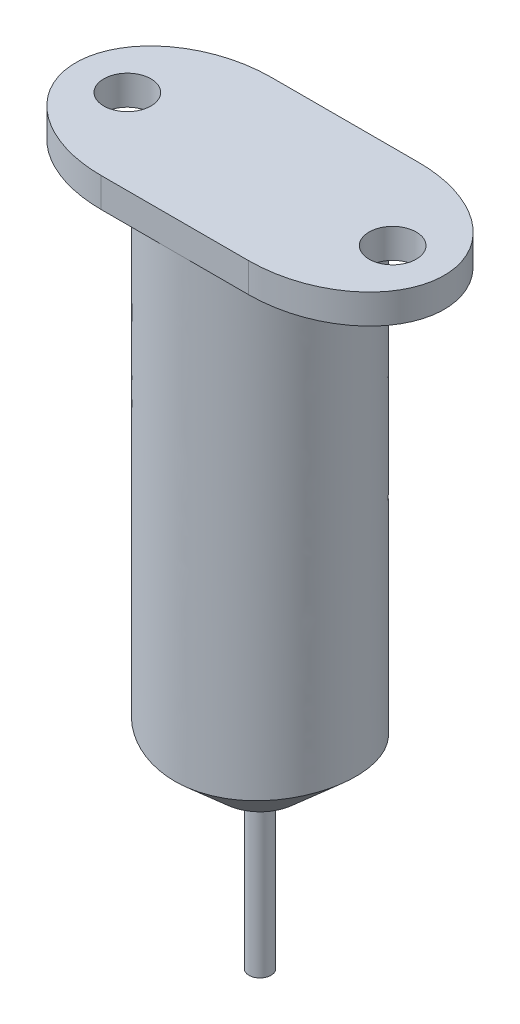
ISO-10303-21;
HEADER;
FILE_DESCRIPTION(('STEP AP214'),'2;1');
FILE_NAME('part.step','',(''),(''),'','','');
FILE_SCHEMA(('AUTOMOTIVE_DESIGN { 1 0 10303 214 1 1 1 1 }'));
ENDSEC;
DATA;
#1=APPLICATION_CONTEXT('core data for automotive mechanical design processes');
#2=APPLICATION_PROTOCOL_DEFINITION('international standard','automotive_design',2000,#1);
#3=PRODUCT_CONTEXT('',#1,'mechanical');
#4=PRODUCT('Part','Part','',(#3));
#5=PRODUCT_RELATED_PRODUCT_CATEGORY('part','',(#4));
#6=PRODUCT_DEFINITION_FORMATION('','',#4);
#7=PRODUCT_DEFINITION_CONTEXT('part definition',#1,'design');
#8=PRODUCT_DEFINITION('design','',#6,#7);
#9=PRODUCT_DEFINITION_SHAPE('','',#8);
#10=(LENGTH_UNIT() NAMED_UNIT(*) SI_UNIT(.MILLI.,.METRE.));
#11=(NAMED_UNIT(*) PLANE_ANGLE_UNIT() SI_UNIT($,.RADIAN.));
#12=(NAMED_UNIT(*) SI_UNIT($,.STERADIAN.) SOLID_ANGLE_UNIT());
#13=UNCERTAINTY_MEASURE_WITH_UNIT(LENGTH_MEASURE(1.E-05),#10,'distance_accuracy_value','');
#14=(GEOMETRIC_REPRESENTATION_CONTEXT(3) GLOBAL_UNCERTAINTY_ASSIGNED_CONTEXT((#13)) GLOBAL_UNIT_ASSIGNED_CONTEXT((#10,
#11,#12)) REPRESENTATION_CONTEXT('',''));
#15=CARTESIAN_POINT('',(0.,0.,0.));
#16=DIRECTION('',(0.,0.,1.));
#17=DIRECTION('',(1.,0.,0.));
#18=AXIS2_PLACEMENT_3D('',#15,#16,#17);
#19=CARTESIAN_POINT('',(0.,45.,0.));
#20=DIRECTION('',(0.,1.,0.));
#21=DIRECTION('',(-0.999622892301415,0.,0.0274603930589759));
#22=AXIS2_PLACEMENT_3D('',#19,#20,#21);
#23=ELLIPSE('',#22,6.50245212475592,5.77217673228334);
#24=DIRECTION('',(0.,-1.,0.));
#25=VECTOR('',#24,1.);
#26=SURFACE_OF_LINEAR_EXTRUSION('',#23,#25);
#27=CARTESIAN_POINT('',(-6.5,14.5577352220053,0.178559891192971));
#28=CARTESIAN_POINT('',(-6.49564268552522,14.5577346311499,0.337107868766625));
#29=CARTESIAN_POINT('',(-6.48391484161751,14.5563432852523,0.495486520774825));
#30=CARTESIAN_POINT('',(-6.44585067105374,14.5508181605295,0.810521077001312));
#31=CARTESIAN_POINT('',(-6.41950418876631,14.5466824748079,0.967175706290462));
#32=CARTESIAN_POINT('',(-6.35254803655993,14.5357928572982,1.27740070330976));
#33=CARTESIAN_POINT('',(-6.31193061655698,14.5290375026456,1.43096934713757));
#34=CARTESIAN_POINT('',(-6.21702032233599,14.5131178025009,1.7335920719539));
#35=CARTESIAN_POINT('',(-6.16273495384329,14.5039547790551,1.88264858060881));
#36=CARTESIAN_POINT('',(-6.04761214513408,14.4845688628163,2.15975643810702));
#37=CARTESIAN_POINT('',(-5.98807182013317,14.4745600492518,2.28836382999139));
#38=CARTESIAN_POINT('',(-5.85926974223257,14.4530691951381,2.54032763955964));
#39=CARTESIAN_POINT('',(-5.79001548737615,14.4415882914555,2.66368801252322));
#40=CARTESIAN_POINT('',(-5.56698287588831,14.4050399502104,3.02766375755327));
#41=CARTESIAN_POINT('',(-5.39902848239854,14.3780566271258,3.2595672572421));
#42=CARTESIAN_POINT('',(-5.03109449917353,14.321274529012,3.69619107506801));
#43=CARTESIAN_POINT('',(-4.83108198849339,14.2914728728342,3.90088304967686));
#44=CARTESIAN_POINT('',(-4.4971565744832,14.2444364639475,4.19807076416744));
#45=CARTESIAN_POINT('',(-4.37212909607511,14.2273485171007,4.30076608630012));
#46=CARTESIAN_POINT('',(-4.11465495560948,14.193450018976,4.49616314044058));
#47=CARTESIAN_POINT('',(-3.98221660041981,14.1766391834114,4.58887573413183));
#48=CARTESIAN_POINT('',(-3.71075469749367,14.143678460735,4.76414237491037));
#49=CARTESIAN_POINT('',(-3.57173268174104,14.1275284214739,4.84669876936278));
#50=CARTESIAN_POINT('',(-3.28785252104862,14.0962450758381,5.00154870798258));
#51=CARTESIAN_POINT('',(-3.1429893785676,14.0811126709777,5.07383321384837));
#52=CARTESIAN_POINT('',(-2.69832124206559,14.0375260214663,5.27617462040616));
#53=CARTESIAN_POINT('',(-2.39083425502038,14.0111826815866,5.3901824045187));
#54=CARTESIAN_POINT('',(-1.76246703827514,13.9665948213839,5.57456593397849));
#55=CARTESIAN_POINT('',(-1.44158284451837,13.9483527169569,5.64492866626996));
#56=CARTESIAN_POINT('',(-0.926592013556915,13.9271406191975,5.7217012749021));
#57=CARTESIAN_POINT('',(-0.734648216525613,13.9209751367441,5.74251288506397));
#58=CARTESIAN_POINT('',(-0.349746209101995,13.9122148249361,5.76886258296317));
#59=CARTESIAN_POINT('',(-0.156788849734979,13.9096173697072,5.7744119059325));
#60=CARTESIAN_POINT('',(0.229018585657553,13.9080748891347,5.77026593366935));
#61=CARTESIAN_POINT('',(0.421868621433498,13.9091308014531,5.76056672514465));
#62=CARTESIAN_POINT('',(0.806181143338068,13.9148610139326,5.72596386694229));
#63=CARTESIAN_POINT('',(0.997643366719899,13.9195359820949,5.7010574105078));
#64=CARTESIAN_POINT('',(1.37784315985664,13.9323540511507,5.63612345534608));
#65=CARTESIAN_POINT('',(1.56658127288944,13.9404964503596,5.59609901614548));
#66=CARTESIAN_POINT('',(1.9401005790579,13.9599788480211,5.50106433100182));
#67=CARTESIAN_POINT('',(2.12488036524323,13.9713199637836,5.44604884892417));
#68=CARTESIAN_POINT('',(2.66733759171398,14.0093441397741,5.26009067999469));
#69=CARTESIAN_POINT('',(3.01758598784452,14.0401918563695,5.10747635442086));
#70=CARTESIAN_POINT('',(3.67386815812256,14.1078847573579,4.75303515752966));
#71=CARTESIAN_POINT('',(3.98109970367889,14.1444460452239,4.55338206232378));
#72=CARTESIAN_POINT('',(4.40521396374506,14.2001177941979,4.22317994926528));
#73=CARTESIAN_POINT('',(4.53721774838329,14.2182919459324,4.11152015468757));
#74=CARTESIAN_POINT('',(4.79144206571678,14.2546949735827,3.87761866935245));
#75=CARTESIAN_POINT('',(4.9136671664535,14.2729238197702,3.75538197572593));
#76=CARTESIAN_POINT('',(5.14026264580795,14.307860532072,3.50839751010545));
#77=CARTESIAN_POINT('',(5.24526231226793,14.3245944319765,3.38423004572123));
#78=CARTESIAN_POINT('',(5.44460225584404,14.3572301971997,3.12755957118415));
#79=CARTESIAN_POINT('',(5.53894628624014,14.3731323544203,2.9950595218156));
#80=CARTESIAN_POINT('',(5.7108721950928,14.4027971619994,2.73030503068256));
#81=CARTESIAN_POINT('',(5.78910975410502,14.4166304516897,2.59848428904223));
#82=CARTESIAN_POINT('',(5.9345633373357,14.4428613850471,2.32855894880352));
#83=CARTESIAN_POINT('',(6.00176739228571,14.4552574653875,2.19044773093002));
#84=CARTESIAN_POINT('',(6.12217715767357,14.4778808255744,1.9137426857152));
#85=CARTESIAN_POINT('',(6.17578475280842,14.4881680246356,1.77532875513494));
#86=CARTESIAN_POINT('',(6.27131473510146,14.5068365832698,1.4943288198223));
#87=CARTESIAN_POINT('',(6.31323243723898,14.5152171784757,1.35174116758916));
#88=CARTESIAN_POINT('',(6.38480918419144,14.5298459581054,1.06349315401138));
#89=CARTESIAN_POINT('',(6.41447504101699,14.5360953271504,0.91783454759457));
#90=CARTESIAN_POINT('',(6.46117319961344,14.5462993062099,0.624491324549964));
#91=CARTESIAN_POINT('',(6.47821147182875,14.5502550005032,0.476807699055086));
#92=CARTESIAN_POINT('',(6.49911522598288,14.5556868113793,0.184889416268921));
#93=CARTESIAN_POINT('',(6.50335783599687,14.5572332529635,0.0406830009112493));
#94=CARTESIAN_POINT('',(6.49966748432606,14.5580295195383,-0.247541482962426));
#95=CARTESIAN_POINT('',(6.49173795781739,14.5572799924294,-0.391559593141967));
#96=CARTESIAN_POINT('',(6.4639127240533,14.5535218145439,-0.677117153590232));
#97=CARTESIAN_POINT('',(6.44412338187759,14.5505331863075,-0.818667261028505));
#98=CARTESIAN_POINT('',(6.39288146458693,14.5423942165786,-1.09962666443907));
#99=CARTESIAN_POINT('',(6.36142471211212,14.5372431007491,-1.239035175001));
#100=CARTESIAN_POINT('',(6.2871483476748,14.5248977403395,-1.51491730936029));
#101=CARTESIAN_POINT('',(6.2443118663192,14.5177004613915,-1.65138624812768));
#102=CARTESIAN_POINT('',(6.14774993845342,14.5014378477465,-1.920350820825));
#103=CARTESIAN_POINT('',(6.09402049739178,14.4923718277441,-2.05284497664387));
#104=CARTESIAN_POINT('',(5.97557557007335,14.4724750591529,-2.3144998238384));
#105=CARTESIAN_POINT('',(5.91074278911893,14.4616255246802,-2.4436059204042));
#106=CARTESIAN_POINT('',(5.7711394163585,14.4384835333932,-2.69625459113307));
#107=CARTESIAN_POINT('',(5.69636467414781,14.426190474212,-2.81979481275148));
#108=CARTESIAN_POINT('',(5.53770386302273,14.4004593764562,-3.06047936360713));
#109=CARTESIAN_POINT('',(5.45383150593176,14.3870230673873,-3.17763292903817));
#110=CARTESIAN_POINT('',(5.27758570064416,14.3592774389311,-3.40525492522882));
#111=CARTESIAN_POINT('',(5.18521141861595,14.3449680339607,-3.51572269851029));
#112=CARTESIAN_POINT('',(4.98521309619861,14.3146418552406,-3.73784038876375));
#113=CARTESIAN_POINT('',(4.87696213240554,14.2985786469657,-3.84892028095591));
#114=CARTESIAN_POINT('',(4.65232870870168,14.2661598078381,-4.06240287879668));
#115=CARTESIAN_POINT('',(4.53594694485021,14.2498042021059,-4.16480632555935));
#116=CARTESIAN_POINT('',(4.17349148606768,14.2005281237089,-4.46044536091017));
#117=CARTESIAN_POINT('',(3.91603877225633,14.1677002755783,-4.63998307242447));
#118=CARTESIAN_POINT('',(3.37777964010551,14.105209952202,-4.96064404044764));
#119=CARTESIAN_POINT('',(3.09695628853842,14.0755498082799,-5.10173912132738));
#120=CARTESIAN_POINT('',(2.64000825862981,14.0332146580667,-5.29332184901522));
#121=CARTESIAN_POINT('',(2.46944814883127,14.018637990024,-5.35697528159644));
#122=CARTESIAN_POINT('',(2.12384547072552,13.9918241456876,-5.47080773388818));
#123=CARTESIAN_POINT('',(1.94880685498851,13.9795849820222,-5.52099821476738));
#124=CARTESIAN_POINT('',(1.59522496258492,13.957786571979,-5.60786350274171));
#125=CARTESIAN_POINT('',(1.41668111607285,13.9482277652725,-5.64453609274491));
#126=CARTESIAN_POINT('',(1.05716336486212,13.9320662760946,-5.70429657837773));
#127=CARTESIAN_POINT('',(0.876188955127212,13.9254642180963,-5.72738160460101));
#128=CARTESIAN_POINT('',(0.512992511956759,13.9154132991876,-5.75991223676583));
#129=CARTESIAN_POINT('',(0.330770902169302,13.9119634163655,-5.7693622636488));
#130=CARTESIAN_POINT('',(-0.0339585524191175,13.9083132123711,-5.77463384307531));
#131=CARTESIAN_POINT('',(-0.21646646880919,13.9081139058121,-5.77045114087872));
#132=CARTESIAN_POINT('',(-0.580580039396283,13.9109728741913,-5.74847880093398));
#133=CARTESIAN_POINT('',(-0.762185951999933,13.9140301547848,-5.7306933170365));
#134=CARTESIAN_POINT('',(-1.12353265130875,13.9233128986598,-5.68157233557689));
#135=CARTESIAN_POINT('',(-1.30327284301993,13.9295393427477,-5.65023264365156));
#136=CARTESIAN_POINT('',(-1.65970979862632,13.944977859495,-5.5741030091585));
#137=CARTESIAN_POINT('',(-1.83640725958474,13.9541892384847,-5.52931619174851));
#138=CARTESIAN_POINT('',(-2.18576836565442,13.9753345639922,-5.42639807054195));
#139=CARTESIAN_POINT('',(-2.35843075125858,13.9872693484031,-5.36826265983279));
#140=CARTESIAN_POINT('',(-2.69854027777515,14.0135140753796,-5.23882254557994));
#141=CARTESIAN_POINT('',(-2.86598807581177,14.0278237172238,-5.16751950928681));
#142=CARTESIAN_POINT('',(-3.19461407686968,14.0584124378189,-5.01191475495209));
#143=CARTESIAN_POINT('',(-3.35579037147734,14.0746921099498,-4.92760911837295));
#144=CARTESIAN_POINT('',(-3.67036727980195,14.1087168786481,-4.74643130328711));
#145=CARTESIAN_POINT('',(-3.82378161076486,14.12645923313,-4.64958245318552));
#146=CARTESIAN_POINT('',(-4.12193933602787,14.1629202274079,-4.4435177969801));
#147=CARTESIAN_POINT('',(-4.26668355911653,14.1816387735672,-4.33430317583269));
#148=CARTESIAN_POINT('',(-4.53848531387516,14.2184492991742,-4.11031157821401));
#149=CARTESIAN_POINT('',(-4.66607873777607,14.2365182785383,-3.99618114263344));
#150=CARTESIAN_POINT('',(-4.91127907108397,14.272543416495,-3.75772205879973));
#151=CARTESIAN_POINT('',(-5.02889050342548,14.2904996227339,-3.63339808008664));
#152=CARTESIAN_POINT('',(-5.24637199812147,14.324756374533,-3.38276202600687));
#153=CARTESIAN_POINT('',(-5.3468815899205,14.3410918247604,-3.25700969179025));
#154=CARTESIAN_POINT('',(-5.53712520280798,14.3728072419687,-2.99755910866571));
#155=CARTESIAN_POINT('',(-5.62686418950382,14.3881876476661,-2.86386456421277));
#156=CARTESIAN_POINT('',(-5.78994060856381,14.4167655660311,-2.59691934560373));
#157=CARTESIAN_POINT('',(-5.86391672427877,14.4300372044275,-2.46406680424517));
#158=CARTESIAN_POINT('',(-6.00066670512859,14.4550420968455,-2.19263705993629));
#159=CARTESIAN_POINT('',(-6.06344561702445,14.466776043294,-2.05406247086562));
#160=CARTESIAN_POINT('',(-6.17453114028064,14.4879192579344,-1.77840074610465));
#161=CARTESIAN_POINT('',(-6.22336617884924,14.4974099932351,-1.64153269545334));
#162=CARTESIAN_POINT('',(-6.3096352326451,14.5144886424021,-1.36418991609748));
#163=CARTESIAN_POINT('',(-6.34707503246485,14.5220775213655,-1.22371705671284));
#164=CARTESIAN_POINT('',(-6.4013638943271,14.5333494336106,-0.979482342544505));
#165=CARTESIAN_POINT('',(-6.42104372391872,14.5375318500094,-0.87636358819244));
#166=CARTESIAN_POINT('',(-6.45410235342741,14.5447530744354,-0.669113425554859));
#167=CARTESIAN_POINT('',(-6.46748342319063,14.54779229435,-0.564982395885022));
#168=CARTESIAN_POINT('',(-6.48801446180343,14.5527252791543,-0.354451244714333));
#169=CARTESIAN_POINT('',(-6.49506482959115,14.5546005958417,-0.248040941605182));
#170=CARTESIAN_POINT('',(-6.50252679841873,14.5571063828998,-0.0348750674160835));
#171=CARTESIAN_POINT('',(-6.50293182298408,14.5577356195628,0.0718807411294624));
#172=CARTESIAN_POINT('',(-6.5,14.5577352220053,0.178559891192971));
#173=B_SPLINE_CURVE_WITH_KNOTS('',3,(#27,#28,#29,#30,#31,#32,#33,#34,#35,#36,#37,#38,#39,#40,
#41,#42,#43,#44,#45,#46,#47,#48,#49,#50,#51,#52,#53,#54,#55,#56,#57,#58,#59,#60,#61,#62,#63,#64,
#65,#66,#67,#68,#69,#70,#71,#72,#73,#74,#75,#76,#77,#78,#79,#80,#81,#82,#83,#84,#85,#86,#87,#88,
#89,#90,#91,#92,#93,#94,#95,#96,#97,#98,#99,#100,#101,#102,#103,#104,#105,#106,#107,#108,#109,
#110,#111,#112,#113,#114,#115,#116,#117,#118,#119,#120,#121,#122,#123,#124,#125,#126,#127,#128,
#129,#130,#131,#132,#133,#134,#135,#136,#137,#138,#139,#140,#141,#142,#143,#144,#145,#146,#147,
#148,#149,#150,#151,#152,#153,#154,#155,#156,#157,#158,#159,#160,#161,#162,#163,#164,#165,#166,
#167,#168,#169,#170,#171,#172),.UNSPECIFIED.,.T.,.F.,(4,2,2,2,2,2,2,2,2,2,2,2,2,2,2,2,2,2,2,2,2,
2,2,2,2,2,2,2,2,2,2,2,2,2,2,2,2,2,2,2,2,2,2,2,2,2,2,2,2,2,2,2,2,2,2,2,2,2,2,2,2,2,2,2,2,2,2,2,2,
2,2,2,4),(0.,0.475704811919901,0.951740512546688,1.42803513334732,1.90406876625963,
2.32983692664159,2.75527823295603,3.61456784563725,4.47474559653319,4.96241491598148,
5.44954814888019,5.93656858008463,6.42401492488249,7.40741570208243,8.39110954585335,
8.97004373499619,9.54855163133993,10.1272080167383,10.7059712353338,11.2846173884718,
11.8634659132245,13.0077644898207,14.1070171437351,14.628072665824,15.1488833418402,
15.6387623130888,16.1284681904804,16.5896994938747,17.0514278865393,17.4972793115467,
17.9433091668512,18.3890906951657,18.8346613189546,19.2669645813697,19.6991458631571,
20.1275079338485,20.5560235221195,20.9851779244824,21.4144899874158,21.848653852167,
22.2829995368701,22.7166994453554,23.1504419346487,23.6177489196554,24.0850159484774,
25.0281269513265,25.9719273372184,26.5193260067625,27.0662571796775,27.6132780158194,
28.1604143297933,28.7073732032315,29.2545027974893,29.8014653826956,30.3485973472607,
30.895602254789,31.4427756833464,31.9898798776683,32.5371492737573,33.0834150712615,
33.6296285667936,34.1454833212352,34.6611030750764,35.1460031851886,35.6306788744157,
36.088088813351,36.5452920663616,36.9816974994837,37.4178810281514,37.7328850909138,
38.0477755504912,38.3675375342261,38.6876159470407),.UNSPECIFIED.);
#174=CARTESIAN_POINT('',(-6.5,14.5577352220053,0.178559891192971));
#175=VERTEX_POINT('',#174);
#176=EDGE_CURVE('E161',#175,#175,#173,.T.);
#177=ORIENTED_EDGE('',*,*,#176,.T.);
#178=EDGE_LOOP('',(#177));
#179=FACE_BOUND('',#178,.T.);
#180=CARTESIAN_POINT('',(0.,45.,0.));
#181=DIRECTION('',(0.,-1.,0.));
#182=DIRECTION('',(-0.999622892301415,0.,0.0274603930589759));
#183=AXIS2_PLACEMENT_3D('',#180,#181,#182);
#184=ELLIPSE('',#183,6.50245212475592,5.77217673228334);
#185=CARTESIAN_POINT('',(-0.243713472304046,45.,5.77));
#186=VERTEX_POINT('',#185);
#187=CARTESIAN_POINT('',(0.158506241874328,45.,5.77));
#188=VERTEX_POINT('',#187);
#189=EDGE_CURVE('E11',#186,#188,#184,.F.);
#190=ORIENTED_EDGE('',*,*,#189,.F.);
#191=CARTESIAN_POINT('',(-0.158506241874328,45.,-5.77));
#192=VERTEX_POINT('',#191);
#193=EDGE_CURVE('E125',#192,#186,#23,.T.);
#194=ORIENTED_EDGE('',*,*,#193,.F.);
#195=CARTESIAN_POINT('',(0.,45.,0.));
#196=DIRECTION('',(0.,-1.,0.));
#197=DIRECTION('',(-0.999622892301415,0.,0.0274603930589759));
#198=AXIS2_PLACEMENT_3D('',#195,#196,#197);
#199=ELLIPSE('',#198,6.50245212475592,5.77217673228334);
#200=CARTESIAN_POINT('',(0.243713472304046,45.,-5.77));
#201=VERTEX_POINT('',#200);
#202=EDGE_CURVE('E53',#201,#192,#199,.F.);
#203=ORIENTED_EDGE('',*,*,#202,.F.);
#204=EDGE_CURVE('E64',#188,#201,#23,.T.);
#205=ORIENTED_EDGE('',*,*,#204,.F.);
#206=EDGE_LOOP('',(#190,#194,#203,#205));
#207=FACE_BOUND('',#206,.T.);
#208=ADVANCED_FACE('F41',(#179,#207),#26,.F.);
#209=CARTESIAN_POINT('',(5.,45.,0.));
#210=DIRECTION('',(0.,1.,0.));
#211=DIRECTION('',(0.,0.,1.));
#212=AXIS2_PLACEMENT_3D('',#209,#210,#211);
#213=PLANE('',#212);
#214=CARTESIAN_POINT('',(9.,45.,0.));
#215=DIRECTION('',(0.,1.,0.));
#216=DIRECTION('',(0.,0.,1.));
#217=AXIS2_PLACEMENT_3D('',#214,#215,#216);
#218=CIRCLE('',#217,1.6);
#219=CARTESIAN_POINT('',(9.,45.,1.6));
#220=VERTEX_POINT('',#219);
#221=EDGE_CURVE('E268',#220,#220,#218,.T.);
#222=ORIENTED_EDGE('',*,*,#221,.T.);
#223=EDGE_LOOP('',(#222));
#224=FACE_BOUND('',#223,.T.);
#225=DIRECTION('',(1.,0.,0.));
#226=VECTOR('',#225,1.);
#227=CARTESIAN_POINT('',(-5.,45.,5.77));
#228=LINE('',#227,#226);
#229=CARTESIAN_POINT('',(5.,45.,5.77));
#230=VERTEX_POINT('',#229);
#231=EDGE_CURVE('E233',#188,#230,#228,.T.);
#232=ORIENTED_EDGE('',*,*,#231,.F.);
#233=ORIENTED_EDGE('',*,*,#204,.T.);
#234=DIRECTION('',(-1.,0.,0.));
#235=VECTOR('',#234,1.);
#236=CARTESIAN_POINT('',(5.,45.,-5.77));
#237=LINE('',#236,#235);
#238=CARTESIAN_POINT('',(5.,45.,-5.77));
#239=VERTEX_POINT('',#238);
#240=EDGE_CURVE('E140',#239,#201,#237,.T.);
#241=ORIENTED_EDGE('',*,*,#240,.F.);
#242=CARTESIAN_POINT('',(5.,45.,0.));
#243=DIRECTION('',(0.,1.,0.));
#244=DIRECTION('',(1.,0.,0.));
#245=AXIS2_PLACEMENT_3D('',#242,#243,#244);
#246=ELLIPSE('',#245,7.49999999999189,5.77);
#247=EDGE_CURVE('E123',#230,#239,#246,.T.);
#248=ORIENTED_EDGE('',*,*,#247,.F.);
#249=EDGE_LOOP('',(#232,#233,#241,#248));
#250=FACE_BOUND('',#249,.T.);
#251=ADVANCED_FACE('F198',(#224,#250),#213,.F.);
#252=CARTESIAN_POINT('',(-9.,45.,0.));
#253=DIRECTION('',(0.,1.,0.));
#254=DIRECTION('',(0.,0.,1.));
#255=AXIS2_PLACEMENT_3D('',#252,#253,#254);
#256=CIRCLE('',#255,1.6);
#257=CARTESIAN_POINT('',(-9.,45.,1.6));
#258=VERTEX_POINT('',#257);
#259=EDGE_CURVE('E265',#258,#258,#256,.T.);
#260=ORIENTED_EDGE('',*,*,#259,.T.);
#261=EDGE_LOOP('',(#260));
#262=FACE_BOUND('',#261,.T.);
#263=CARTESIAN_POINT('',(-5.,45.,-5.77));
#264=VERTEX_POINT('',#263);
#265=EDGE_CURVE('E174',#192,#264,#237,.T.);
#266=ORIENTED_EDGE('',*,*,#265,.F.);
#267=ORIENTED_EDGE('',*,*,#193,.T.);
#268=CARTESIAN_POINT('',(-5.,45.,5.77));
#269=VERTEX_POINT('',#268);
#270=EDGE_CURVE('E119',#269,#186,#228,.T.);
#271=ORIENTED_EDGE('',*,*,#270,.F.);
#272=CARTESIAN_POINT('',(-5.,45.,0.));
#273=DIRECTION('',(0.,1.,0.));
#274=DIRECTION('',(-1.,0.,0.));
#275=AXIS2_PLACEMENT_3D('',#272,#273,#274);
#276=ELLIPSE('',#275,7.49999999999189,5.77);
#277=EDGE_CURVE('E177',#264,#269,#276,.T.);
#278=ORIENTED_EDGE('',*,*,#277,.F.);
#279=EDGE_LOOP('',(#266,#267,#271,#278));
#280=FACE_BOUND('',#279,.T.);
#281=ADVANCED_FACE('F157',(#262,#280),#213,.F.);
#282=CARTESIAN_POINT('',(5.,47.,0.));
#283=DIRECTION('',(0.,1.,0.));
#284=DIRECTION('',(1.,0.,0.));
#285=AXIS2_PLACEMENT_3D('',#282,#283,#284);
#286=ELLIPSE('',#285,7.49999999999189,5.77);
#287=DIRECTION('',(0.,-1.,0.));
#288=VECTOR('',#287,1.);
#289=SURFACE_OF_LINEAR_EXTRUSION('',#286,#288);
#290=ORIENTED_EDGE('',*,*,#247,.T.);
#291=DIRECTION('',(0.,-1.,0.));
#292=VECTOR('',#291,1.);
#293=CARTESIAN_POINT('',(5.,47.,-5.77));
#294=LINE('',#293,#292);
#295=CARTESIAN_POINT('',(5.,47.,-5.77));
#296=VERTEX_POINT('',#295);
#297=EDGE_CURVE('E101',#296,#239,#294,.T.);
#298=ORIENTED_EDGE('',*,*,#297,.F.);
#299=CARTESIAN_POINT('',(5.,47.,5.77));
#300=VERTEX_POINT('',#299);
#301=EDGE_CURVE('E109',#300,#296,#286,.T.);
#302=ORIENTED_EDGE('',*,*,#301,.F.);
#303=DIRECTION('',(0.,-1.,0.));
#304=VECTOR('',#303,1.);
#305=CARTESIAN_POINT('',(5.,47.,5.77));
#306=LINE('',#305,#304);
#307=EDGE_CURVE('E172',#300,#230,#306,.T.);
#308=ORIENTED_EDGE('',*,*,#307,.T.);
#309=EDGE_LOOP('',(#290,#298,#302,#308));
#310=FACE_BOUND('',#309,.T.);
#311=ADVANCED_FACE('F121',(#310),#289,.F.);
#312=CARTESIAN_POINT('',(5.,47.,-5.77));
#313=DIRECTION('',(0.,0.,1.));
#314=DIRECTION('',(1.,0.,0.));
#315=AXIS2_PLACEMENT_3D('',#312,#313,#314);
#316=PLANE('',#315);
#317=ORIENTED_EDGE('',*,*,#240,.T.);
#318=ORIENTED_EDGE('',*,*,#202,.T.);
#319=ORIENTED_EDGE('',*,*,#265,.T.);
#320=DIRECTION('',(0.,-1.,0.));
#321=VECTOR('',#320,1.);
#322=CARTESIAN_POINT('',(-5.,47.,-5.77));
#323=LINE('',#322,#321);
#324=CARTESIAN_POINT('',(-5.,47.,-5.77));
#325=VERTEX_POINT('',#324);
#326=EDGE_CURVE('E104',#325,#264,#323,.T.);
#327=ORIENTED_EDGE('',*,*,#326,.F.);
#328=DIRECTION('',(-1.,0.,0.));
#329=VECTOR('',#328,1.);
#330=CARTESIAN_POINT('',(5.,47.,-5.77));
#331=LINE('',#330,#329);
#332=EDGE_CURVE('E96',#296,#325,#331,.T.);
#333=ORIENTED_EDGE('',*,*,#332,.F.);
#334=ORIENTED_EDGE('',*,*,#297,.T.);
#335=EDGE_LOOP('',(#317,#318,#319,#327,#333,#334));
#336=FACE_BOUND('',#335,.T.);
#337=ADVANCED_FACE('F99',(#336),#316,.F.);
#338=CARTESIAN_POINT('',(-5.,47.,0.));
#339=DIRECTION('',(0.,1.,0.));
#340=DIRECTION('',(-1.,0.,0.));
#341=AXIS2_PLACEMENT_3D('',#338,#339,#340);
#342=ELLIPSE('',#341,7.49999999999189,5.77);
#343=DIRECTION('',(0.,-1.,0.));
#344=VECTOR('',#343,1.);
#345=SURFACE_OF_LINEAR_EXTRUSION('',#342,#344);
#346=ORIENTED_EDGE('',*,*,#277,.T.);
#347=DIRECTION('',(0.,-1.,0.));
#348=VECTOR('',#347,1.);
#349=CARTESIAN_POINT('',(-5.,47.,5.77));
#350=LINE('',#349,#348);
#351=CARTESIAN_POINT('',(-5.,47.,5.77));
#352=VERTEX_POINT('',#351);
#353=EDGE_CURVE('E131',#352,#269,#350,.T.);
#354=ORIENTED_EDGE('',*,*,#353,.F.);
#355=EDGE_CURVE('E108',#325,#352,#342,.T.);
#356=ORIENTED_EDGE('',*,*,#355,.F.);
#357=ORIENTED_EDGE('',*,*,#326,.T.);
#358=EDGE_LOOP('',(#346,#354,#356,#357));
#359=FACE_BOUND('',#358,.T.);
#360=ADVANCED_FACE('F152',(#359),#345,.F.);
#361=CARTESIAN_POINT('',(-5.,47.,5.77));
#362=DIRECTION('',(0.,0.,-1.));
#363=DIRECTION('',(-1.,0.,0.));
#364=AXIS2_PLACEMENT_3D('',#361,#362,#363);
#365=PLANE('',#364);
#366=ORIENTED_EDGE('',*,*,#270,.T.);
#367=ORIENTED_EDGE('',*,*,#189,.T.);
#368=ORIENTED_EDGE('',*,*,#231,.T.);
#369=ORIENTED_EDGE('',*,*,#307,.F.);
#370=DIRECTION('',(1.,0.,0.));
#371=VECTOR('',#370,1.);
#372=CARTESIAN_POINT('',(-5.,47.,5.77));
#373=LINE('',#372,#371);
#374=EDGE_CURVE('E114',#352,#300,#373,.T.);
#375=ORIENTED_EDGE('',*,*,#374,.F.);
#376=ORIENTED_EDGE('',*,*,#353,.T.);
#377=EDGE_LOOP('',(#366,#367,#368,#369,#375,#376));
#378=FACE_BOUND('',#377,.T.);
#379=ADVANCED_FACE('F189',(#378),#365,.F.);
#380=CARTESIAN_POINT('',(5.,47.,0.));
#381=DIRECTION('',(0.,1.,0.));
#382=DIRECTION('',(0.,0.,1.));
#383=AXIS2_PLACEMENT_3D('',#380,#381,#382);
#384=PLANE('',#383);
#385=CARTESIAN_POINT('',(-9.,47.,0.));
#386=DIRECTION('',(0.,1.,0.));
#387=DIRECTION('',(0.,0.,1.));
#388=AXIS2_PLACEMENT_3D('',#385,#386,#387);
#389=CIRCLE('',#388,1.6);
#390=CARTESIAN_POINT('',(-9.,47.,1.6));
#391=VERTEX_POINT('',#390);
#392=EDGE_CURVE('E272',#391,#391,#389,.T.);
#393=ORIENTED_EDGE('',*,*,#392,.F.);
#394=EDGE_LOOP('',(#393));
#395=FACE_BOUND('',#394,.T.);
#396=CARTESIAN_POINT('',(9.,47.,0.));
#397=DIRECTION('',(0.,1.,0.));
#398=DIRECTION('',(0.,0.,1.));
#399=AXIS2_PLACEMENT_3D('',#396,#397,#398);
#400=CIRCLE('',#399,1.6);
#401=CARTESIAN_POINT('',(9.,47.,1.6));
#402=VERTEX_POINT('',#401);
#403=EDGE_CURVE('E275',#402,#402,#400,.T.);
#404=ORIENTED_EDGE('',*,*,#403,.F.);
#405=EDGE_LOOP('',(#404));
#406=FACE_BOUND('',#405,.T.);
#407=ORIENTED_EDGE('',*,*,#301,.T.);
#408=ORIENTED_EDGE('',*,*,#332,.T.);
#409=ORIENTED_EDGE('',*,*,#355,.T.);
#410=ORIENTED_EDGE('',*,*,#374,.T.);
#411=EDGE_LOOP('',(#407,#408,#409,#410));
#412=FACE_BOUND('',#411,.T.);
#413=ADVANCED_FACE('F112',(#395,#406,#412),#384,.T.);
#414=CARTESIAN_POINT('',(0.,11.,0.));
#415=DIRECTION('',(0.,1.,0.));
#416=DIRECTION('',(0.,0.,1.));
#417=AXIS2_PLACEMENT_3D('',#414,#415,#416);
#418=CONICAL_SURFACE('',#417,2.5,0.844153986113171);
#419=CARTESIAN_POINT('',(0.,11.,0.));
#420=DIRECTION('',(0.,1.,0.));
#421=DIRECTION('',(0.,0.,1.));
#422=AXIS2_PLACEMENT_3D('',#419,#420,#421);
#423=CIRCLE('',#422,2.5);
#424=CARTESIAN_POINT('',(0.,11.,2.5));
#425=VERTEX_POINT('',#424);
#426=EDGE_CURVE('E262',#425,#425,#423,.T.);
#427=ORIENTED_EDGE('',*,*,#426,.T.);
#428=EDGE_LOOP('',(#427));
#429=FACE_BOUND('',#428,.T.);
#430=ORIENTED_EDGE('',*,*,#176,.F.);
#431=EDGE_LOOP('',(#430));
#432=FACE_BOUND('',#431,.T.);
#433=ADVANCED_FACE('F203',(#429,#432),#418,.T.);
#434=CARTESIAN_POINT('',(0.,0.,0.));
#435=DIRECTION('',(0.,1.,0.));
#436=DIRECTION('',(0.,0.,1.));
#437=AXIS2_PLACEMENT_3D('',#434,#435,#436);
#438=PLANE('',#437);
#439=CARTESIAN_POINT('',(0.,0.,0.));
#440=DIRECTION('',(0.,1.,0.));
#441=DIRECTION('',(0.,0.,1.));
#442=AXIS2_PLACEMENT_3D('',#439,#440,#441);
#443=CIRCLE('',#442,0.75);
#444=CARTESIAN_POINT('',(0.,0.,0.75));
#445=VERTEX_POINT('',#444);
#446=EDGE_CURVE('E240',#445,#445,#443,.T.);
#447=ORIENTED_EDGE('',*,*,#446,.F.);
#448=EDGE_LOOP('',(#447));
#449=FACE_BOUND('',#448,.T.);
#450=ADVANCED_FACE('F208',(#449),#438,.F.);
#451=CARTESIAN_POINT('',(0.,11.,0.));
#452=DIRECTION('',(0.,-1.,0.));
#453=DIRECTION('',(0.,0.,-1.));
#454=AXIS2_PLACEMENT_3D('',#451,#452,#453);
#455=CYLINDRICAL_SURFACE('',#454,0.75);
#456=CARTESIAN_POINT('',(0.,11.,0.));
#457=DIRECTION('',(0.,1.,0.));
#458=DIRECTION('',(0.,0.,1.));
#459=AXIS2_PLACEMENT_3D('',#456,#457,#458);
#460=CIRCLE('',#459,0.75);
#461=CARTESIAN_POINT('',(0.,11.,0.75));
#462=VERTEX_POINT('',#461);
#463=EDGE_CURVE('E234',#462,#462,#460,.T.);
#464=ORIENTED_EDGE('',*,*,#463,.F.);
#465=EDGE_LOOP('',(#464));
#466=FACE_BOUND('',#465,.T.);
#467=ORIENTED_EDGE('',*,*,#446,.T.);
#468=EDGE_LOOP('',(#467));
#469=FACE_BOUND('',#468,.T.);
#470=ADVANCED_FACE('F43',(#466,#469),#455,.T.);
#471=CARTESIAN_POINT('',(0.,11.,0.));
#472=DIRECTION('',(0.,1.,0.));
#473=DIRECTION('',(0.,0.,1.));
#474=AXIS2_PLACEMENT_3D('',#471,#472,#473);
#475=PLANE('',#474);
#476=ORIENTED_EDGE('',*,*,#463,.T.);
#477=EDGE_LOOP('',(#476));
#478=FACE_BOUND('',#477,.T.);
#479=ORIENTED_EDGE('',*,*,#426,.F.);
#480=EDGE_LOOP('',(#479));
#481=FACE_BOUND('',#480,.T.);
#482=ADVANCED_FACE('F158',(#478,#481),#475,.F.);
#483=CARTESIAN_POINT('',(9.,0.,0.));
#484=DIRECTION('',(0.,1.,0.));
#485=DIRECTION('',(0.,0.,1.));
#486=AXIS2_PLACEMENT_3D('',#483,#484,#485);
#487=CYLINDRICAL_SURFACE('',#486,1.6);
#488=ORIENTED_EDGE('',*,*,#403,.T.);
#489=EDGE_LOOP('',(#488));
#490=FACE_BOUND('',#489,.T.);
#491=ORIENTED_EDGE('',*,*,#221,.F.);
#492=EDGE_LOOP('',(#491));
#493=FACE_BOUND('',#492,.T.);
#494=ADVANCED_FACE('F210',(#490,#493),#487,.F.);
#495=CARTESIAN_POINT('',(-9.,0.,0.));
#496=DIRECTION('',(0.,1.,0.));
#497=DIRECTION('',(0.,0.,1.));
#498=AXIS2_PLACEMENT_3D('',#495,#496,#497);
#499=CYLINDRICAL_SURFACE('',#498,1.6);
#500=ORIENTED_EDGE('',*,*,#392,.T.);
#501=EDGE_LOOP('',(#500));
#502=FACE_BOUND('',#501,.T.);
#503=ORIENTED_EDGE('',*,*,#259,.F.);
#504=EDGE_LOOP('',(#503));
#505=FACE_BOUND('',#504,.T.);
#506=ADVANCED_FACE('F213',(#502,#505),#499,.F.);
#507=CLOSED_SHELL('',(#208,#251,#281,#311,#337,#360,#379,#413,#433,#450,#470,#482,#494,#506));
#508=MANIFOLD_SOLID_BREP('B2',#507);
#509=ADVANCED_BREP_SHAPE_REPRESENTATION('',(#18,#508),#14);
#510=SHAPE_DEFINITION_REPRESENTATION(#9,#509);
ENDSEC;
END-ISO-10303-21;
